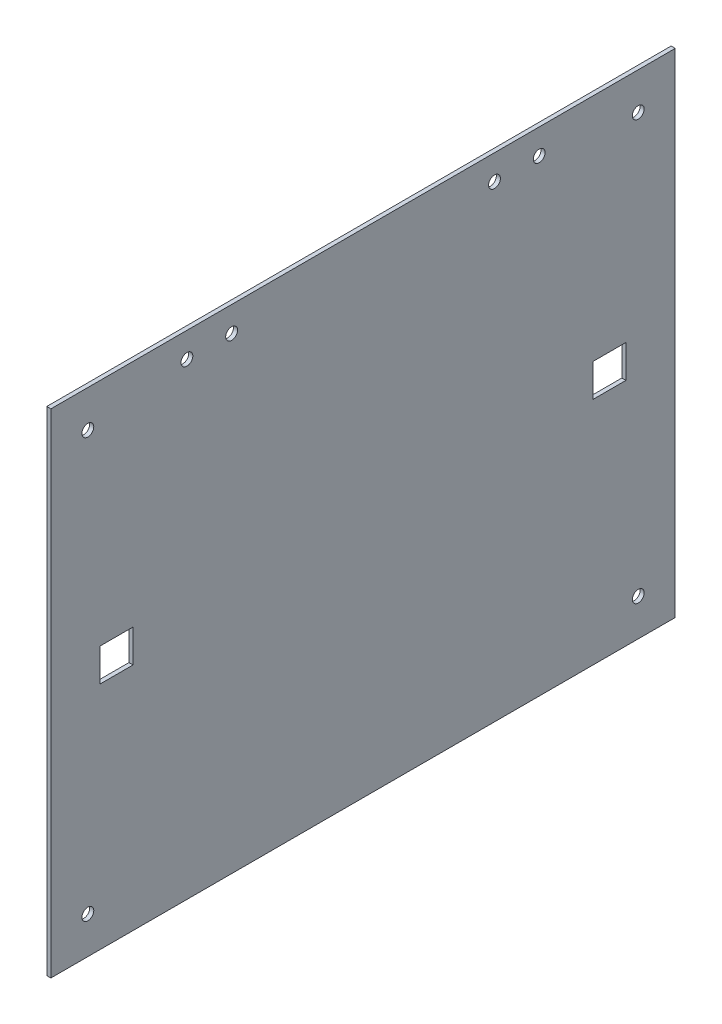
ISO-10303-21;
HEADER;
FILE_DESCRIPTION(('STEP AP214'),'2;1');
FILE_NAME('part.step','',(''),(''),'','','');
FILE_SCHEMA(('AUTOMOTIVE_DESIGN { 1 0 10303 214 1 1 1 1 }'));
ENDSEC;
DATA;
#1=APPLICATION_CONTEXT('core data for automotive mechanical design processes');
#2=APPLICATION_PROTOCOL_DEFINITION('international standard','automotive_design',2000,#1);
#3=PRODUCT_CONTEXT('',#1,'mechanical');
#4=PRODUCT('Part','Part','',(#3));
#5=PRODUCT_RELATED_PRODUCT_CATEGORY('part','',(#4));
#6=PRODUCT_DEFINITION_FORMATION('','',#4);
#7=PRODUCT_DEFINITION_CONTEXT('part definition',#1,'design');
#8=PRODUCT_DEFINITION('design','',#6,#7);
#9=PRODUCT_DEFINITION_SHAPE('','',#8);
#10=(LENGTH_UNIT() NAMED_UNIT(*) SI_UNIT(.MILLI.,.METRE.));
#11=(NAMED_UNIT(*) PLANE_ANGLE_UNIT() SI_UNIT($,.RADIAN.));
#12=(NAMED_UNIT(*) SI_UNIT($,.STERADIAN.) SOLID_ANGLE_UNIT());
#13=UNCERTAINTY_MEASURE_WITH_UNIT(LENGTH_MEASURE(1.E-05),#10,'distance_accuracy_value','');
#14=(GEOMETRIC_REPRESENTATION_CONTEXT(3) GLOBAL_UNCERTAINTY_ASSIGNED_CONTEXT((#13)) GLOBAL_UNIT_ASSIGNED_CONTEXT((#10,
#11,#12)) REPRESENTATION_CONTEXT('',''));
#15=CARTESIAN_POINT('',(0.,0.,0.));
#16=DIRECTION('',(0.,0.,1.));
#17=DIRECTION('',(1.,0.,0.));
#18=AXIS2_PLACEMENT_3D('',#15,#16,#17);
#19=CARTESIAN_POINT('',(1.5875,0.,0.));
#20=DIRECTION('',(0.,0.,-1.));
#21=DIRECTION('',(-1.,0.,0.));
#22=AXIS2_PLACEMENT_3D('',#19,#20,#21);
#23=PLANE('',#22);
#24=DIRECTION('',(0.,-1.,0.));
#25=VECTOR('',#24,1.);
#26=CARTESIAN_POINT('',(0.,0.,0.));
#27=LINE('',#26,#25);
#28=CARTESIAN_POINT('',(0.,190.5,0.));
#29=VERTEX_POINT('',#28);
#30=CARTESIAN_POINT('',(0.,0.,0.));
#31=VERTEX_POINT('',#30);
#32=EDGE_CURVE('E242',#29,#31,#27,.T.);
#33=ORIENTED_EDGE('',*,*,#32,.T.);
#34=DIRECTION('',(-1.,0.,0.));
#35=VECTOR('',#34,1.);
#36=CARTESIAN_POINT('',(1.5875,0.,0.));
#37=LINE('',#36,#35);
#38=CARTESIAN_POINT('',(1.5875,0.,0.));
#39=VERTEX_POINT('',#38);
#40=EDGE_CURVE('E11',#39,#31,#37,.T.);
#41=ORIENTED_EDGE('',*,*,#40,.F.);
#42=DIRECTION('',(0.,-1.,0.));
#43=VECTOR('',#42,1.);
#44=CARTESIAN_POINT('',(1.5875,0.,0.));
#45=LINE('',#44,#43);
#46=CARTESIAN_POINT('',(1.5875,190.5,0.));
#47=VERTEX_POINT('',#46);
#48=EDGE_CURVE('E245',#47,#39,#45,.T.);
#49=ORIENTED_EDGE('',*,*,#48,.F.);
#50=DIRECTION('',(-1.,0.,0.));
#51=VECTOR('',#50,1.);
#52=CARTESIAN_POINT('',(1.5875,190.5,0.));
#53=LINE('',#52,#51);
#54=EDGE_CURVE('E255',#47,#29,#53,.T.);
#55=ORIENTED_EDGE('',*,*,#54,.T.);
#56=EDGE_LOOP('',(#33,#41,#49,#55));
#57=FACE_BOUND('',#56,.T.);
#58=ADVANCED_FACE('F39',(#57),#23,.F.);
#59=CARTESIAN_POINT('',(1.5875,0.,0.));
#60=DIRECTION('',(0.,1.,0.));
#61=DIRECTION('',(0.,0.,1.));
#62=AXIS2_PLACEMENT_3D('',#59,#60,#61);
#63=PLANE('',#62);
#64=DIRECTION('',(0.,0.,-1.));
#65=VECTOR('',#64,1.);
#66=CARTESIAN_POINT('',(0.,0.,0.));
#67=LINE('',#66,#65);
#68=CARTESIAN_POINT('',(0.,0.,-241.3));
#69=VERTEX_POINT('',#68);
#70=EDGE_CURVE('E258',#31,#69,#67,.T.);
#71=ORIENTED_EDGE('',*,*,#70,.T.);
#72=DIRECTION('',(-1.,0.,0.));
#73=VECTOR('',#72,1.);
#74=CARTESIAN_POINT('',(1.5875,0.,-241.3));
#75=LINE('',#74,#73);
#76=CARTESIAN_POINT('',(1.5875,0.,-241.3));
#77=VERTEX_POINT('',#76);
#78=EDGE_CURVE('E46',#77,#69,#75,.T.);
#79=ORIENTED_EDGE('',*,*,#78,.F.);
#80=DIRECTION('',(0.,0.,-1.));
#81=VECTOR('',#80,1.);
#82=CARTESIAN_POINT('',(1.5875,0.,0.));
#83=LINE('',#82,#81);
#84=EDGE_CURVE('E248',#39,#77,#83,.T.);
#85=ORIENTED_EDGE('',*,*,#84,.F.);
#86=ORIENTED_EDGE('',*,*,#40,.T.);
#87=EDGE_LOOP('',(#71,#79,#85,#86));
#88=FACE_BOUND('',#87,.T.);
#89=ADVANCED_FACE('F287',(#88),#63,.F.);
#90=CARTESIAN_POINT('',(1.5875,0.,-241.3));
#91=DIRECTION('',(0.,0.,1.));
#92=DIRECTION('',(1.,0.,0.));
#93=AXIS2_PLACEMENT_3D('',#90,#91,#92);
#94=PLANE('',#93);
#95=DIRECTION('',(0.,1.,0.));
#96=VECTOR('',#95,1.);
#97=CARTESIAN_POINT('',(0.,0.,-241.3));
#98=LINE('',#97,#96);
#99=CARTESIAN_POINT('',(0.,190.5,-241.3));
#100=VERTEX_POINT('',#99);
#101=EDGE_CURVE('E260',#69,#100,#98,.T.);
#102=ORIENTED_EDGE('',*,*,#101,.T.);
#103=DIRECTION('',(-1.,0.,0.));
#104=VECTOR('',#103,1.);
#105=CARTESIAN_POINT('',(1.5875,190.5,-241.3));
#106=LINE('',#105,#104);
#107=CARTESIAN_POINT('',(1.5875,190.5,-241.3));
#108=VERTEX_POINT('',#107);
#109=EDGE_CURVE('E265',#108,#100,#106,.T.);
#110=ORIENTED_EDGE('',*,*,#109,.F.);
#111=DIRECTION('',(0.,1.,0.));
#112=VECTOR('',#111,1.);
#113=CARTESIAN_POINT('',(1.5875,0.,-241.3));
#114=LINE('',#113,#112);
#115=EDGE_CURVE('E251',#77,#108,#114,.T.);
#116=ORIENTED_EDGE('',*,*,#115,.F.);
#117=ORIENTED_EDGE('',*,*,#78,.T.);
#118=EDGE_LOOP('',(#102,#110,#116,#117));
#119=FACE_BOUND('',#118,.T.);
#120=ADVANCED_FACE('F272',(#119),#94,.F.);
#121=CARTESIAN_POINT('',(1.5875,190.5,0.));
#122=DIRECTION('',(0.,-1.,0.));
#123=DIRECTION('',(0.,0.,-1.));
#124=AXIS2_PLACEMENT_3D('',#121,#122,#123);
#125=PLANE('',#124);
#126=DIRECTION('',(0.,0.,1.));
#127=VECTOR('',#126,1.);
#128=CARTESIAN_POINT('',(0.,190.5,0.));
#129=LINE('',#128,#127);
#130=EDGE_CURVE('E249',#100,#29,#129,.T.);
#131=ORIENTED_EDGE('',*,*,#130,.T.);
#132=ORIENTED_EDGE('',*,*,#54,.F.);
#133=DIRECTION('',(0.,0.,1.));
#134=VECTOR('',#133,1.);
#135=CARTESIAN_POINT('',(1.5875,190.5,0.));
#136=LINE('',#135,#134);
#137=EDGE_CURVE('E253',#108,#47,#136,.T.);
#138=ORIENTED_EDGE('',*,*,#137,.F.);
#139=ORIENTED_EDGE('',*,*,#109,.T.);
#140=EDGE_LOOP('',(#131,#132,#138,#139));
#141=FACE_BOUND('',#140,.T.);
#142=ADVANCED_FACE('F280',(#141),#125,.F.);
#143=CARTESIAN_POINT('',(1.5875,0.,0.));
#144=DIRECTION('',(-1.,0.,0.));
#145=DIRECTION('',(0.,0.,1.));
#146=AXIS2_PLACEMENT_3D('',#143,#144,#145);
#147=PLANE('',#146);
#148=DIRECTION('',(0.,0.,-1.));
#149=VECTOR('',#148,1.);
#150=CARTESIAN_POINT('',(1.5875,88.9,-19.05));
#151=LINE('',#150,#149);
#152=CARTESIAN_POINT('',(1.5875,88.9,-19.05));
#153=VERTEX_POINT('',#152);
#154=CARTESIAN_POINT('',(1.5875,88.9,-31.75));
#155=VERTEX_POINT('',#154);
#156=EDGE_CURVE('E157',#153,#155,#151,.T.);
#157=ORIENTED_EDGE('',*,*,#156,.F.);
#158=DIRECTION('',(0.,-1.,0.));
#159=VECTOR('',#158,1.);
#160=CARTESIAN_POINT('',(1.5875,101.6,-19.05));
#161=LINE('',#160,#159);
#162=CARTESIAN_POINT('',(1.5875,101.6,-19.05));
#163=VERTEX_POINT('',#162);
#164=EDGE_CURVE('E53',#163,#153,#161,.T.);
#165=ORIENTED_EDGE('',*,*,#164,.F.);
#166=DIRECTION('',(0.,0.,1.));
#167=VECTOR('',#166,1.);
#168=CARTESIAN_POINT('',(1.5875,101.6,-19.05));
#169=LINE('',#168,#167);
#170=CARTESIAN_POINT('',(1.5875,101.6,-31.75));
#171=VERTEX_POINT('',#170);
#172=EDGE_CURVE('E148',#171,#163,#169,.T.);
#173=ORIENTED_EDGE('',*,*,#172,.F.);
#174=DIRECTION('',(0.,1.,0.));
#175=VECTOR('',#174,1.);
#176=CARTESIAN_POINT('',(1.5875,101.6,-31.75));
#177=LINE('',#176,#175);
#178=EDGE_CURVE('E151',#155,#171,#177,.T.);
#179=ORIENTED_EDGE('',*,*,#178,.F.);
#180=EDGE_LOOP('',(#157,#165,#173,#179));
#181=FACE_BOUND('',#180,.T.);
#182=DIRECTION('',(0.,0.,-1.));
#183=VECTOR('',#182,1.);
#184=CARTESIAN_POINT('',(1.5875,88.9,-209.55));
#185=LINE('',#184,#183);
#186=CARTESIAN_POINT('',(1.5875,88.9,-209.55));
#187=VERTEX_POINT('',#186);
#188=CARTESIAN_POINT('',(1.5875,88.9,-222.25));
#189=VERTEX_POINT('',#188);
#190=EDGE_CURVE('E183',#187,#189,#185,.T.);
#191=ORIENTED_EDGE('',*,*,#190,.F.);
#192=DIRECTION('',(0.,-1.,0.));
#193=VECTOR('',#192,1.);
#194=CARTESIAN_POINT('',(1.5875,88.9,-209.55));
#195=LINE('',#194,#193);
#196=CARTESIAN_POINT('',(1.5875,101.6,-209.55));
#197=VERTEX_POINT('',#196);
#198=EDGE_CURVE('E61',#197,#187,#195,.T.);
#199=ORIENTED_EDGE('',*,*,#198,.F.);
#200=DIRECTION('',(0.,0.,1.));
#201=VECTOR('',#200,1.);
#202=CARTESIAN_POINT('',(1.5875,101.6,-209.55));
#203=LINE('',#202,#201);
#204=CARTESIAN_POINT('',(1.5875,101.6,-222.25));
#205=VERTEX_POINT('',#204);
#206=EDGE_CURVE('E172',#205,#197,#203,.T.);
#207=ORIENTED_EDGE('',*,*,#206,.F.);
#208=DIRECTION('',(0.,1.,0.));
#209=VECTOR('',#208,1.);
#210=CARTESIAN_POINT('',(1.5875,88.9,-222.25));
#211=LINE('',#210,#209);
#212=EDGE_CURVE('E186',#189,#205,#211,.T.);
#213=ORIENTED_EDGE('',*,*,#212,.F.);
#214=EDGE_LOOP('',(#191,#199,#207,#213));
#215=FACE_BOUND('',#214,.T.);
#216=CARTESIAN_POINT('',(1.5875,180.7845,-52.578));
#217=DIRECTION('',(1.,0.,0.));
#218=DIRECTION('',(0.,0.,-1.));
#219=AXIS2_PLACEMENT_3D('',#216,#217,#218);
#220=CIRCLE('',#219,2.28599999999996);
#221=CARTESIAN_POINT('',(1.5875,180.7845,-54.864));
#222=VERTEX_POINT('',#221);
#223=EDGE_CURVE('E201',#222,#222,#220,.T.);
#224=ORIENTED_EDGE('',*,*,#223,.F.);
#225=EDGE_LOOP('',(#224));
#226=FACE_BOUND('',#225,.T.);
#227=CARTESIAN_POINT('',(1.5875,180.7845,-69.85));
#228=DIRECTION('',(1.,0.,0.));
#229=DIRECTION('',(0.,0.,-1.));
#230=AXIS2_PLACEMENT_3D('',#227,#228,#229);
#231=CIRCLE('',#230,2.28600000000001);
#232=CARTESIAN_POINT('',(1.5875,180.7845,-72.136));
#233=VERTEX_POINT('',#232);
#234=EDGE_CURVE('E207',#233,#233,#231,.T.);
#235=ORIENTED_EDGE('',*,*,#234,.F.);
#236=EDGE_LOOP('',(#235));
#237=FACE_BOUND('',#236,.T.);
#238=CARTESIAN_POINT('',(1.5875,180.7845,-171.45));
#239=DIRECTION('',(1.,0.,0.));
#240=DIRECTION('',(0.,0.,-1.));
#241=AXIS2_PLACEMENT_3D('',#238,#239,#240);
#242=CIRCLE('',#241,2.28600000000001);
#243=CARTESIAN_POINT('',(1.5875,180.7845,-173.736));
#244=VERTEX_POINT('',#243);
#245=EDGE_CURVE('E213',#244,#244,#242,.T.);
#246=ORIENTED_EDGE('',*,*,#245,.F.);
#247=EDGE_LOOP('',(#246));
#248=FACE_BOUND('',#247,.T.);
#249=CARTESIAN_POINT('',(1.5875,180.7845,-188.722));
#250=DIRECTION('',(1.,0.,0.));
#251=DIRECTION('',(0.,0.,-1.));
#252=AXIS2_PLACEMENT_3D('',#249,#250,#251);
#253=CIRCLE('',#252,2.28600000000001);
#254=CARTESIAN_POINT('',(1.5875,180.7845,-191.008));
#255=VERTEX_POINT('',#254);
#256=EDGE_CURVE('E164',#255,#255,#253,.T.);
#257=ORIENTED_EDGE('',*,*,#256,.F.);
#258=EDGE_LOOP('',(#257));
#259=FACE_BOUND('',#258,.T.);
#260=CARTESIAN_POINT('',(1.5875,176.2125,-227.0125));
#261=DIRECTION('',(1.,0.,0.));
#262=DIRECTION('',(0.,0.,1.));
#263=AXIS2_PLACEMENT_3D('',#260,#261,#262);
#264=CIRCLE('',#263,2.28600000000001);
#265=CARTESIAN_POINT('',(1.5875,176.2125,-224.7265));
#266=VERTEX_POINT('',#265);
#267=EDGE_CURVE('E231',#266,#266,#264,.T.);
#268=ORIENTED_EDGE('',*,*,#267,.F.);
#269=EDGE_LOOP('',(#268));
#270=FACE_BOUND('',#269,.T.);
#271=CARTESIAN_POINT('',(1.5875,14.2875,-14.2875));
#272=DIRECTION('',(1.,0.,0.));
#273=DIRECTION('',(0.,0.,1.));
#274=AXIS2_PLACEMENT_3D('',#271,#272,#273);
#275=CIRCLE('',#274,2.28600000000001);
#276=CARTESIAN_POINT('',(1.5875,14.2875,-12.0015));
#277=VERTEX_POINT('',#276);
#278=EDGE_CURVE('E224',#277,#277,#275,.T.);
#279=ORIENTED_EDGE('',*,*,#278,.F.);
#280=EDGE_LOOP('',(#279));
#281=FACE_BOUND('',#280,.T.);
#282=CARTESIAN_POINT('',(1.5875,176.2125,-14.2875));
#283=DIRECTION('',(1.,0.,0.));
#284=DIRECTION('',(0.,0.,-1.));
#285=AXIS2_PLACEMENT_3D('',#282,#283,#284);
#286=CIRCLE('',#285,2.28600000000001);
#287=CARTESIAN_POINT('',(1.5875,176.2125,-16.5735));
#288=VERTEX_POINT('',#287);
#289=EDGE_CURVE('E200',#288,#288,#286,.T.);
#290=ORIENTED_EDGE('',*,*,#289,.F.);
#291=EDGE_LOOP('',(#290));
#292=FACE_BOUND('',#291,.T.);
#293=CARTESIAN_POINT('',(1.5875,14.2875,-227.0125));
#294=DIRECTION('',(1.,0.,0.));
#295=DIRECTION('',(0.,0.,-1.));
#296=AXIS2_PLACEMENT_3D('',#293,#294,#295);
#297=CIRCLE('',#296,2.28600000000001);
#298=CARTESIAN_POINT('',(1.5875,14.2875,-229.2985));
#299=VERTEX_POINT('',#298);
#300=EDGE_CURVE('E230',#299,#299,#297,.T.);
#301=ORIENTED_EDGE('',*,*,#300,.F.);
#302=EDGE_LOOP('',(#301));
#303=FACE_BOUND('',#302,.T.);
#304=ORIENTED_EDGE('',*,*,#48,.T.);
#305=ORIENTED_EDGE('',*,*,#84,.T.);
#306=ORIENTED_EDGE('',*,*,#115,.T.);
#307=ORIENTED_EDGE('',*,*,#137,.T.);
#308=EDGE_LOOP('',(#304,#305,#306,#307));
#309=FACE_BOUND('',#308,.T.);
#310=ADVANCED_FACE('F286',(#181,#215,#226,#237,#248,#259,#270,#281,#292,#303,#309),#147,.F.);
#311=CARTESIAN_POINT('',(0.,0.,0.));
#312=DIRECTION('',(-1.,0.,0.));
#313=DIRECTION('',(0.,0.,1.));
#314=AXIS2_PLACEMENT_3D('',#311,#312,#313);
#315=PLANE('',#314);
#316=DIRECTION('',(0.,-1.,0.));
#317=VECTOR('',#316,1.);
#318=CARTESIAN_POINT('',(0.,101.6,-19.05));
#319=LINE('',#318,#317);
#320=CARTESIAN_POINT('',(0.,101.6,-19.05));
#321=VERTEX_POINT('',#320);
#322=CARTESIAN_POINT('',(0.,88.9,-19.05));
#323=VERTEX_POINT('',#322);
#324=EDGE_CURVE('E129',#321,#323,#319,.T.);
#325=ORIENTED_EDGE('',*,*,#324,.T.);
#326=DIRECTION('',(0.,0.,-1.));
#327=VECTOR('',#326,1.);
#328=CARTESIAN_POINT('',(0.,88.9,-19.05));
#329=LINE('',#328,#327);
#330=CARTESIAN_POINT('',(0.,88.9,-31.75));
#331=VERTEX_POINT('',#330);
#332=EDGE_CURVE('E139',#323,#331,#329,.T.);
#333=ORIENTED_EDGE('',*,*,#332,.T.);
#334=DIRECTION('',(0.,1.,0.));
#335=VECTOR('',#334,1.);
#336=CARTESIAN_POINT('',(0.,101.6,-31.75));
#337=LINE('',#336,#335);
#338=CARTESIAN_POINT('',(0.,101.6,-31.75));
#339=VERTEX_POINT('',#338);
#340=EDGE_CURVE('E143',#331,#339,#337,.T.);
#341=ORIENTED_EDGE('',*,*,#340,.T.);
#342=DIRECTION('',(0.,0.,1.));
#343=VECTOR('',#342,1.);
#344=CARTESIAN_POINT('',(0.,101.6,-19.05));
#345=LINE('',#344,#343);
#346=EDGE_CURVE('E135',#339,#321,#345,.T.);
#347=ORIENTED_EDGE('',*,*,#346,.T.);
#348=EDGE_LOOP('',(#325,#333,#341,#347));
#349=FACE_BOUND('',#348,.T.);
#350=DIRECTION('',(0.,-1.,0.));
#351=VECTOR('',#350,1.);
#352=CARTESIAN_POINT('',(0.,88.9,-209.55));
#353=LINE('',#352,#351);
#354=CARTESIAN_POINT('',(0.,101.6,-209.55));
#355=VERTEX_POINT('',#354);
#356=CARTESIAN_POINT('',(0.,88.9,-209.55));
#357=VERTEX_POINT('',#356);
#358=EDGE_CURVE('E168',#355,#357,#353,.T.);
#359=ORIENTED_EDGE('',*,*,#358,.T.);
#360=DIRECTION('',(0.,0.,-1.));
#361=VECTOR('',#360,1.);
#362=CARTESIAN_POINT('',(0.,88.9,-209.55));
#363=LINE('',#362,#361);
#364=CARTESIAN_POINT('',(0.,88.9,-222.25));
#365=VERTEX_POINT('',#364);
#366=EDGE_CURVE('E171',#357,#365,#363,.T.);
#367=ORIENTED_EDGE('',*,*,#366,.T.);
#368=DIRECTION('',(0.,1.,0.));
#369=VECTOR('',#368,1.);
#370=CARTESIAN_POINT('',(0.,88.9,-222.25));
#371=LINE('',#370,#369);
#372=CARTESIAN_POINT('',(0.,101.6,-222.25));
#373=VERTEX_POINT('',#372);
#374=EDGE_CURVE('E175',#365,#373,#371,.T.);
#375=ORIENTED_EDGE('',*,*,#374,.T.);
#376=DIRECTION('',(0.,0.,1.));
#377=VECTOR('',#376,1.);
#378=CARTESIAN_POINT('',(0.,101.6,-209.55));
#379=LINE('',#378,#377);
#380=EDGE_CURVE('E178',#373,#355,#379,.T.);
#381=ORIENTED_EDGE('',*,*,#380,.T.);
#382=EDGE_LOOP('',(#359,#367,#375,#381));
#383=FACE_BOUND('',#382,.T.);
#384=CARTESIAN_POINT('',(0.,180.7845,-52.578));
#385=DIRECTION('',(1.,0.,0.));
#386=DIRECTION('',(0.,0.,-1.));
#387=AXIS2_PLACEMENT_3D('',#384,#385,#386);
#388=CIRCLE('',#387,2.28599999999996);
#389=CARTESIAN_POINT('',(0.,180.7845,-54.864));
#390=VERTEX_POINT('',#389);
#391=EDGE_CURVE('E197',#390,#390,#388,.T.);
#392=ORIENTED_EDGE('',*,*,#391,.T.);
#393=EDGE_LOOP('',(#392));
#394=FACE_BOUND('',#393,.T.);
#395=CARTESIAN_POINT('',(0.,180.7845,-69.85));
#396=DIRECTION('',(1.,0.,0.));
#397=DIRECTION('',(0.,0.,-1.));
#398=AXIS2_PLACEMENT_3D('',#395,#396,#397);
#399=CIRCLE('',#398,2.28600000000001);
#400=CARTESIAN_POINT('',(0.,180.7845,-72.136));
#401=VERTEX_POINT('',#400);
#402=EDGE_CURVE('E204',#401,#401,#399,.T.);
#403=ORIENTED_EDGE('',*,*,#402,.T.);
#404=EDGE_LOOP('',(#403));
#405=FACE_BOUND('',#404,.T.);
#406=CARTESIAN_POINT('',(0.,180.7845,-171.45));
#407=DIRECTION('',(1.,0.,0.));
#408=DIRECTION('',(0.,0.,-1.));
#409=AXIS2_PLACEMENT_3D('',#406,#407,#408);
#410=CIRCLE('',#409,2.28600000000001);
#411=CARTESIAN_POINT('',(0.,180.7845,-173.736));
#412=VERTEX_POINT('',#411);
#413=EDGE_CURVE('E210',#412,#412,#410,.T.);
#414=ORIENTED_EDGE('',*,*,#413,.T.);
#415=EDGE_LOOP('',(#414));
#416=FACE_BOUND('',#415,.T.);
#417=CARTESIAN_POINT('',(0.,180.7845,-188.722));
#418=DIRECTION('',(1.,0.,0.));
#419=DIRECTION('',(0.,0.,-1.));
#420=AXIS2_PLACEMENT_3D('',#417,#418,#419);
#421=CIRCLE('',#420,2.28600000000001);
#422=CARTESIAN_POINT('',(0.,180.7845,-191.008));
#423=VERTEX_POINT('',#422);
#424=EDGE_CURVE('E216',#423,#423,#421,.T.);
#425=ORIENTED_EDGE('',*,*,#424,.T.);
#426=EDGE_LOOP('',(#425));
#427=FACE_BOUND('',#426,.T.);
#428=CARTESIAN_POINT('',(0.,176.2125,-227.0125));
#429=DIRECTION('',(1.,0.,0.));
#430=DIRECTION('',(0.,0.,1.));
#431=AXIS2_PLACEMENT_3D('',#428,#429,#430);
#432=CIRCLE('',#431,2.28600000000001);
#433=CARTESIAN_POINT('',(0.,176.2125,-224.7265));
#434=VERTEX_POINT('',#433);
#435=EDGE_CURVE('E227',#434,#434,#432,.T.);
#436=ORIENTED_EDGE('',*,*,#435,.T.);
#437=EDGE_LOOP('',(#436));
#438=FACE_BOUND('',#437,.T.);
#439=CARTESIAN_POINT('',(0.,14.2875,-14.2875));
#440=DIRECTION('',(1.,0.,0.));
#441=DIRECTION('',(0.,0.,1.));
#442=AXIS2_PLACEMENT_3D('',#439,#440,#441);
#443=CIRCLE('',#442,2.28600000000001);
#444=CARTESIAN_POINT('',(0.,14.2875,-12.0015));
#445=VERTEX_POINT('',#444);
#446=EDGE_CURVE('E234',#445,#445,#443,.T.);
#447=ORIENTED_EDGE('',*,*,#446,.T.);
#448=EDGE_LOOP('',(#447));
#449=FACE_BOUND('',#448,.T.);
#450=CARTESIAN_POINT('',(0.,176.2125,-14.2875));
#451=DIRECTION('',(1.,0.,0.));
#452=DIRECTION('',(0.,0.,-1.));
#453=AXIS2_PLACEMENT_3D('',#450,#451,#452);
#454=CIRCLE('',#453,2.28600000000001);
#455=CARTESIAN_POINT('',(0.,176.2125,-16.5735));
#456=VERTEX_POINT('',#455);
#457=EDGE_CURVE('E221',#456,#456,#454,.T.);
#458=ORIENTED_EDGE('',*,*,#457,.T.);
#459=EDGE_LOOP('',(#458));
#460=FACE_BOUND('',#459,.T.);
#461=CARTESIAN_POINT('',(0.,14.2875,-227.0125));
#462=DIRECTION('',(1.,0.,0.));
#463=DIRECTION('',(0.,0.,-1.));
#464=AXIS2_PLACEMENT_3D('',#461,#462,#463);
#465=CIRCLE('',#464,2.28600000000001);
#466=CARTESIAN_POINT('',(0.,14.2875,-229.2985));
#467=VERTEX_POINT('',#466);
#468=EDGE_CURVE('E239',#467,#467,#465,.T.);
#469=ORIENTED_EDGE('',*,*,#468,.T.);
#470=EDGE_LOOP('',(#469));
#471=FACE_BOUND('',#470,.T.);
#472=ORIENTED_EDGE('',*,*,#32,.F.);
#473=ORIENTED_EDGE('',*,*,#130,.F.);
#474=ORIENTED_EDGE('',*,*,#101,.F.);
#475=ORIENTED_EDGE('',*,*,#70,.F.);
#476=EDGE_LOOP('',(#472,#473,#474,#475));
#477=FACE_BOUND('',#476,.T.);
#478=ADVANCED_FACE('F145',(#349,#383,#394,#405,#416,#427,#438,#449,#460,#471,#477),#315,.T.);
#479=CARTESIAN_POINT('',(0.,14.2875,-227.0125));
#480=DIRECTION('',(1.,0.,0.));
#481=DIRECTION('',(0.,0.,-1.));
#482=AXIS2_PLACEMENT_3D('',#479,#480,#481);
#483=CYLINDRICAL_SURFACE('',#482,2.28600000000001);
#484=ORIENTED_EDGE('',*,*,#468,.F.);
#485=EDGE_LOOP('',(#484));
#486=FACE_BOUND('',#485,.T.);
#487=ORIENTED_EDGE('',*,*,#300,.T.);
#488=EDGE_LOOP('',(#487));
#489=FACE_BOUND('',#488,.T.);
#490=ADVANCED_FACE('F299',(#486,#489),#483,.F.);
#491=CARTESIAN_POINT('',(0.,176.2125,-14.2875));
#492=DIRECTION('',(1.,0.,0.));
#493=DIRECTION('',(0.,0.,-1.));
#494=AXIS2_PLACEMENT_3D('',#491,#492,#493);
#495=CYLINDRICAL_SURFACE('',#494,2.28600000000001);
#496=ORIENTED_EDGE('',*,*,#457,.F.);
#497=EDGE_LOOP('',(#496));
#498=FACE_BOUND('',#497,.T.);
#499=ORIENTED_EDGE('',*,*,#289,.T.);
#500=EDGE_LOOP('',(#499));
#501=FACE_BOUND('',#500,.T.);
#502=ADVANCED_FACE('F305',(#498,#501),#495,.F.);
#503=CARTESIAN_POINT('',(0.,14.2875,-14.2875));
#504=DIRECTION('',(1.,0.,0.));
#505=DIRECTION('',(0.,0.,-1.));
#506=AXIS2_PLACEMENT_3D('',#503,#504,#505);
#507=CYLINDRICAL_SURFACE('',#506,2.28600000000001);
#508=ORIENTED_EDGE('',*,*,#446,.F.);
#509=EDGE_LOOP('',(#508));
#510=FACE_BOUND('',#509,.T.);
#511=ORIENTED_EDGE('',*,*,#278,.T.);
#512=EDGE_LOOP('',(#511));
#513=FACE_BOUND('',#512,.T.);
#514=ADVANCED_FACE('F307',(#510,#513),#507,.F.);
#515=CARTESIAN_POINT('',(0.,176.2125,-227.0125));
#516=DIRECTION('',(1.,0.,0.));
#517=DIRECTION('',(0.,0.,-1.));
#518=AXIS2_PLACEMENT_3D('',#515,#516,#517);
#519=CYLINDRICAL_SURFACE('',#518,2.28600000000001);
#520=ORIENTED_EDGE('',*,*,#435,.F.);
#521=EDGE_LOOP('',(#520));
#522=FACE_BOUND('',#521,.T.);
#523=ORIENTED_EDGE('',*,*,#267,.T.);
#524=EDGE_LOOP('',(#523));
#525=FACE_BOUND('',#524,.T.);
#526=ADVANCED_FACE('F310',(#522,#525),#519,.F.);
#527=CARTESIAN_POINT('',(0.,180.7845,-188.722));
#528=DIRECTION('',(1.,0.,0.));
#529=DIRECTION('',(0.,0.,-1.));
#530=AXIS2_PLACEMENT_3D('',#527,#528,#529);
#531=CYLINDRICAL_SURFACE('',#530,2.28600000000001);
#532=ORIENTED_EDGE('',*,*,#424,.F.);
#533=EDGE_LOOP('',(#532));
#534=FACE_BOUND('',#533,.T.);
#535=ORIENTED_EDGE('',*,*,#256,.T.);
#536=EDGE_LOOP('',(#535));
#537=FACE_BOUND('',#536,.T.);
#538=ADVANCED_FACE('F314',(#534,#537),#531,.F.);
#539=CARTESIAN_POINT('',(0.,180.7845,-171.45));
#540=DIRECTION('',(1.,0.,0.));
#541=DIRECTION('',(0.,0.,-1.));
#542=AXIS2_PLACEMENT_3D('',#539,#540,#541);
#543=CYLINDRICAL_SURFACE('',#542,2.28600000000001);
#544=ORIENTED_EDGE('',*,*,#413,.F.);
#545=EDGE_LOOP('',(#544));
#546=FACE_BOUND('',#545,.T.);
#547=ORIENTED_EDGE('',*,*,#245,.T.);
#548=EDGE_LOOP('',(#547));
#549=FACE_BOUND('',#548,.T.);
#550=ADVANCED_FACE('F321',(#546,#549),#543,.F.);
#551=CARTESIAN_POINT('',(0.,180.7845,-69.85));
#552=DIRECTION('',(1.,0.,0.));
#553=DIRECTION('',(0.,0.,-1.));
#554=AXIS2_PLACEMENT_3D('',#551,#552,#553);
#555=CYLINDRICAL_SURFACE('',#554,2.28600000000001);
#556=ORIENTED_EDGE('',*,*,#402,.F.);
#557=EDGE_LOOP('',(#556));
#558=FACE_BOUND('',#557,.T.);
#559=ORIENTED_EDGE('',*,*,#234,.T.);
#560=EDGE_LOOP('',(#559));
#561=FACE_BOUND('',#560,.T.);
#562=ADVANCED_FACE('F325',(#558,#561),#555,.F.);
#563=CARTESIAN_POINT('',(0.,180.7845,-52.578));
#564=DIRECTION('',(1.,0.,0.));
#565=DIRECTION('',(0.,0.,-1.));
#566=AXIS2_PLACEMENT_3D('',#563,#564,#565);
#567=CYLINDRICAL_SURFACE('',#566,2.28599999999996);
#568=ORIENTED_EDGE('',*,*,#391,.F.);
#569=EDGE_LOOP('',(#568));
#570=FACE_BOUND('',#569,.T.);
#571=ORIENTED_EDGE('',*,*,#223,.T.);
#572=EDGE_LOOP('',(#571));
#573=FACE_BOUND('',#572,.T.);
#574=ADVANCED_FACE('F329',(#570,#573),#567,.F.);
#575=CARTESIAN_POINT('',(0.,88.9,-209.55));
#576=DIRECTION('',(0.,0.,1.));
#577=DIRECTION('',(1.,0.,0.));
#578=AXIS2_PLACEMENT_3D('',#575,#576,#577);
#579=PLANE('',#578);
#580=ORIENTED_EDGE('',*,*,#198,.T.);
#581=DIRECTION('',(1.,0.,0.));
#582=VECTOR('',#581,1.);
#583=CARTESIAN_POINT('',(0.,88.9,-209.55));
#584=LINE('',#583,#582);
#585=EDGE_CURVE('E181',#357,#187,#584,.T.);
#586=ORIENTED_EDGE('',*,*,#585,.F.);
#587=ORIENTED_EDGE('',*,*,#358,.F.);
#588=DIRECTION('',(1.,0.,0.));
#589=VECTOR('',#588,1.);
#590=CARTESIAN_POINT('',(0.,101.6,-209.55));
#591=LINE('',#590,#589);
#592=EDGE_CURVE('E158',#355,#197,#591,.T.);
#593=ORIENTED_EDGE('',*,*,#592,.T.);
#594=EDGE_LOOP('',(#580,#586,#587,#593));
#595=FACE_BOUND('',#594,.T.);
#596=ADVANCED_FACE('F333',(#595),#579,.F.);
#597=CARTESIAN_POINT('',(0.,101.6,-209.55));
#598=DIRECTION('',(0.,1.,0.));
#599=DIRECTION('',(0.,0.,1.));
#600=AXIS2_PLACEMENT_3D('',#597,#598,#599);
#601=PLANE('',#600);
#602=ORIENTED_EDGE('',*,*,#206,.T.);
#603=ORIENTED_EDGE('',*,*,#592,.F.);
#604=ORIENTED_EDGE('',*,*,#380,.F.);
#605=DIRECTION('',(1.,0.,0.));
#606=VECTOR('',#605,1.);
#607=CARTESIAN_POINT('',(0.,101.6,-222.25));
#608=LINE('',#607,#606);
#609=EDGE_CURVE('E192',#373,#205,#608,.T.);
#610=ORIENTED_EDGE('',*,*,#609,.T.);
#611=EDGE_LOOP('',(#602,#603,#604,#610));
#612=FACE_BOUND('',#611,.T.);
#613=ADVANCED_FACE('F337',(#612),#601,.F.);
#614=CARTESIAN_POINT('',(0.,88.9,-222.25));
#615=DIRECTION('',(0.,0.,-1.));
#616=DIRECTION('',(-1.,0.,0.));
#617=AXIS2_PLACEMENT_3D('',#614,#615,#616);
#618=PLANE('',#617);
#619=ORIENTED_EDGE('',*,*,#212,.T.);
#620=ORIENTED_EDGE('',*,*,#609,.F.);
#621=ORIENTED_EDGE('',*,*,#374,.F.);
#622=DIRECTION('',(1.,0.,0.));
#623=VECTOR('',#622,1.);
#624=CARTESIAN_POINT('',(0.,88.9,-222.25));
#625=LINE('',#624,#623);
#626=EDGE_CURVE('E194',#365,#189,#625,.T.);
#627=ORIENTED_EDGE('',*,*,#626,.T.);
#628=EDGE_LOOP('',(#619,#620,#621,#627));
#629=FACE_BOUND('',#628,.T.);
#630=ADVANCED_FACE('F341',(#629),#618,.F.);
#631=CARTESIAN_POINT('',(0.,88.9,-209.55));
#632=DIRECTION('',(0.,-1.,0.));
#633=DIRECTION('',(0.,0.,-1.));
#634=AXIS2_PLACEMENT_3D('',#631,#632,#633);
#635=PLANE('',#634);
#636=ORIENTED_EDGE('',*,*,#190,.T.);
#637=ORIENTED_EDGE('',*,*,#626,.F.);
#638=ORIENTED_EDGE('',*,*,#366,.F.);
#639=ORIENTED_EDGE('',*,*,#585,.T.);
#640=EDGE_LOOP('',(#636,#637,#638,#639));
#641=FACE_BOUND('',#640,.T.);
#642=ADVANCED_FACE('F338',(#641),#635,.F.);
#643=CARTESIAN_POINT('',(0.,101.6,-19.05));
#644=DIRECTION('',(0.,0.,1.));
#645=DIRECTION('',(1.,0.,0.));
#646=AXIS2_PLACEMENT_3D('',#643,#644,#645);
#647=PLANE('',#646);
#648=ORIENTED_EDGE('',*,*,#164,.T.);
#649=DIRECTION('',(1.,0.,0.));
#650=VECTOR('',#649,1.);
#651=CARTESIAN_POINT('',(0.,88.9,-19.05));
#652=LINE('',#651,#650);
#653=EDGE_CURVE('E125',#323,#153,#652,.T.);
#654=ORIENTED_EDGE('',*,*,#653,.F.);
#655=ORIENTED_EDGE('',*,*,#324,.F.);
#656=DIRECTION('',(1.,0.,0.));
#657=VECTOR('',#656,1.);
#658=CARTESIAN_POINT('',(0.,101.6,-19.05));
#659=LINE('',#658,#657);
#660=EDGE_CURVE('E162',#321,#163,#659,.T.);
#661=ORIENTED_EDGE('',*,*,#660,.T.);
#662=EDGE_LOOP('',(#648,#654,#655,#661));
#663=FACE_BOUND('',#662,.T.);
#664=ADVANCED_FACE('F127',(#663),#647,.F.);
#665=CARTESIAN_POINT('',(0.,101.6,-19.05));
#666=DIRECTION('',(0.,1.,0.));
#667=DIRECTION('',(0.,0.,1.));
#668=AXIS2_PLACEMENT_3D('',#665,#666,#667);
#669=PLANE('',#668);
#670=ORIENTED_EDGE('',*,*,#172,.T.);
#671=ORIENTED_EDGE('',*,*,#660,.F.);
#672=ORIENTED_EDGE('',*,*,#346,.F.);
#673=DIRECTION('',(1.,0.,0.));
#674=VECTOR('',#673,1.);
#675=CARTESIAN_POINT('',(0.,101.6,-31.75));
#676=LINE('',#675,#674);
#677=EDGE_CURVE('E165',#339,#171,#676,.T.);
#678=ORIENTED_EDGE('',*,*,#677,.T.);
#679=EDGE_LOOP('',(#670,#671,#672,#678));
#680=FACE_BOUND('',#679,.T.);
#681=ADVANCED_FACE('F351',(#680),#669,.F.);
#682=CARTESIAN_POINT('',(0.,101.6,-31.75));
#683=DIRECTION('',(0.,0.,-1.));
#684=DIRECTION('',(0.,1.,0.));
#685=AXIS2_PLACEMENT_3D('',#682,#683,#684);
#686=PLANE('',#685);
#687=ORIENTED_EDGE('',*,*,#178,.T.);
#688=ORIENTED_EDGE('',*,*,#677,.F.);
#689=ORIENTED_EDGE('',*,*,#340,.F.);
#690=DIRECTION('',(1.,0.,0.));
#691=VECTOR('',#690,1.);
#692=CARTESIAN_POINT('',(0.,88.9,-31.75));
#693=LINE('',#692,#691);
#694=EDGE_CURVE('E134',#331,#155,#693,.T.);
#695=ORIENTED_EDGE('',*,*,#694,.T.);
#696=EDGE_LOOP('',(#687,#688,#689,#695));
#697=FACE_BOUND('',#696,.T.);
#698=ADVANCED_FACE('F354',(#697),#686,.F.);
#699=CARTESIAN_POINT('',(0.,88.9,-19.05));
#700=DIRECTION('',(0.,-1.,0.));
#701=DIRECTION('',(0.,0.,-1.));
#702=AXIS2_PLACEMENT_3D('',#699,#700,#701);
#703=PLANE('',#702);
#704=ORIENTED_EDGE('',*,*,#156,.T.);
#705=ORIENTED_EDGE('',*,*,#694,.F.);
#706=ORIENTED_EDGE('',*,*,#332,.F.);
#707=ORIENTED_EDGE('',*,*,#653,.T.);
#708=EDGE_LOOP('',(#704,#705,#706,#707));
#709=FACE_BOUND('',#708,.T.);
#710=ADVANCED_FACE('F140',(#709),#703,.F.);
#711=CLOSED_SHELL('',(#58,#89,#120,#142,#310,#478,#490,#502,#514,#526,#538,#550,#562,#574,#596,
#613,#630,#642,#664,#681,#698,#710));
#712=MANIFOLD_SOLID_BREP('B2',#711);
#713=ADVANCED_BREP_SHAPE_REPRESENTATION('',(#18,#712),#14);
#714=SHAPE_DEFINITION_REPRESENTATION(#9,#713);
ENDSEC;
END-ISO-10303-21;
